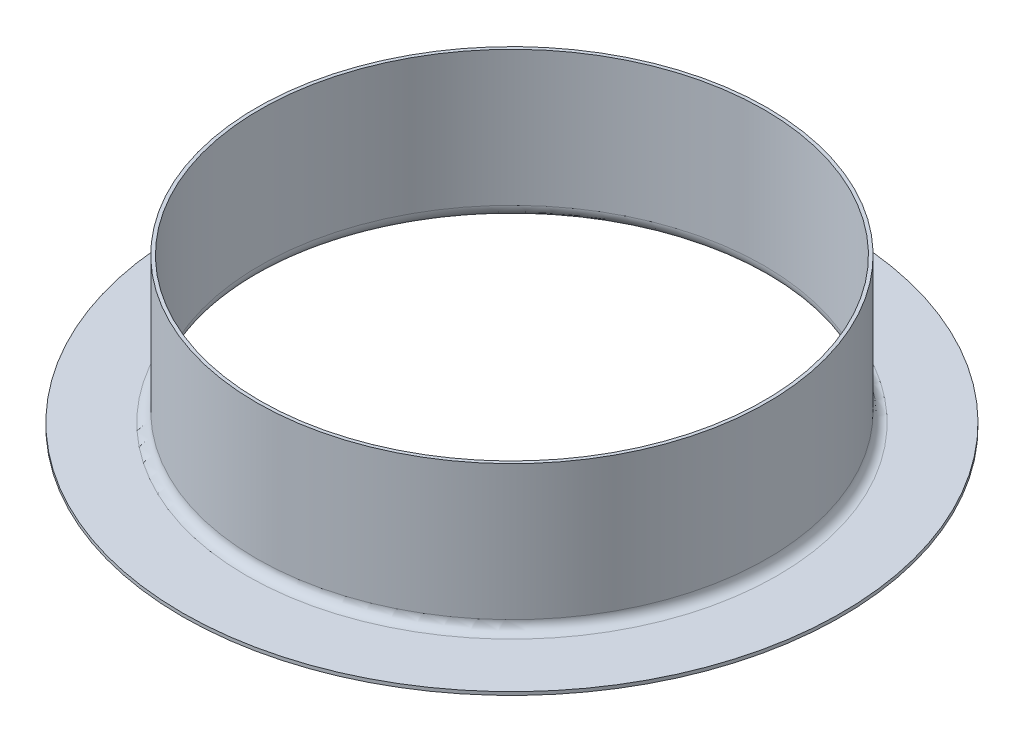
ISO-10303-21;
HEADER;
FILE_DESCRIPTION(('STEP AP214'),'2;1');
FILE_NAME('part.step','',(''),(''),'','','');
FILE_SCHEMA(('AUTOMOTIVE_DESIGN { 1 0 10303 214 1 1 1 1 }'));
ENDSEC;
DATA;
#1=APPLICATION_CONTEXT('core data for automotive mechanical design processes');
#2=APPLICATION_PROTOCOL_DEFINITION('international standard','automotive_design',2000,#1);
#3=PRODUCT_CONTEXT('',#1,'mechanical');
#4=PRODUCT('Part','Part','',(#3));
#5=PRODUCT_RELATED_PRODUCT_CATEGORY('part','',(#4));
#6=PRODUCT_DEFINITION_FORMATION('','',#4);
#7=PRODUCT_DEFINITION_CONTEXT('part definition',#1,'design');
#8=PRODUCT_DEFINITION('design','',#6,#7);
#9=PRODUCT_DEFINITION_SHAPE('','',#8);
#10=(LENGTH_UNIT() NAMED_UNIT(*) SI_UNIT(.MILLI.,.METRE.));
#11=(NAMED_UNIT(*) PLANE_ANGLE_UNIT() SI_UNIT($,.RADIAN.));
#12=(NAMED_UNIT(*) SI_UNIT($,.STERADIAN.) SOLID_ANGLE_UNIT());
#13=UNCERTAINTY_MEASURE_WITH_UNIT(LENGTH_MEASURE(1.E-05),#10,'distance_accuracy_value','');
#14=(GEOMETRIC_REPRESENTATION_CONTEXT(3) GLOBAL_UNCERTAINTY_ASSIGNED_CONTEXT((#13)) GLOBAL_UNIT_ASSIGNED_CONTEXT((#10,
#11,#12)) REPRESENTATION_CONTEXT('',''));
#15=CARTESIAN_POINT('',(0.,0.,0.));
#16=DIRECTION('',(0.,0.,1.));
#17=DIRECTION('',(1.,0.,0.));
#18=AXIS2_PLACEMENT_3D('',#15,#16,#17);
#19=CARTESIAN_POINT('',(0.,-0.999999999999995,0.));
#20=DIRECTION('',(0.,1.,0.));
#21=DIRECTION('',(0.,0.,1.));
#22=AXIS2_PLACEMENT_3D('',#19,#20,#21);
#23=CYLINDRICAL_SURFACE('',#22,100.);
#24=CARTESIAN_POINT('',(0.,-0.999999999999995,0.));
#25=DIRECTION('',(0.,1.,0.));
#26=DIRECTION('',(0.,0.,1.));
#27=AXIS2_PLACEMENT_3D('',#24,#25,#26);
#28=CIRCLE('',#27,100.);
#29=CARTESIAN_POINT('',(0.,-0.999999999999995,100.));
#30=VERTEX_POINT('',#29);
#31=EDGE_CURVE('E12',#30,#30,#28,.T.);
#32=ORIENTED_EDGE('',*,*,#31,.T.);
#33=EDGE_LOOP('',(#32));
#34=FACE_BOUND('',#33,.T.);
#35=CARTESIAN_POINT('',(0.,0.,0.));
#36=DIRECTION('',(0.,1.,0.));
#37=DIRECTION('',(0.,0.,1.));
#38=AXIS2_PLACEMENT_3D('',#35,#36,#37);
#39=CIRCLE('',#38,100.);
#40=CARTESIAN_POINT('',(0.,0.,100.));
#41=VERTEX_POINT('',#40);
#42=EDGE_CURVE('E101',#41,#41,#39,.T.);
#43=ORIENTED_EDGE('',*,*,#42,.F.);
#44=EDGE_LOOP('',(#43));
#45=FACE_BOUND('',#44,.T.);
#46=ADVANCED_FACE('F98',(#34,#45),#23,.T.);
#47=CARTESIAN_POINT('',(0.,-0.999999999999995,0.));
#48=DIRECTION('',(0.,1.,0.));
#49=DIRECTION('',(0.,0.,1.));
#50=AXIS2_PLACEMENT_3D('',#47,#48,#49);
#51=PLANE('',#50);
#52=ORIENTED_EDGE('',*,*,#31,.F.);
#53=EDGE_LOOP('',(#52));
#54=FACE_BOUND('',#53,.T.);
#55=CARTESIAN_POINT('',(0.,-0.999999999999995,0.));
#56=DIRECTION('',(0.,1.,0.));
#57=DIRECTION('',(0.,0.,1.));
#58=AXIS2_PLACEMENT_3D('',#55,#56,#57);
#59=CIRCLE('',#58,80.5);
#60=CARTESIAN_POINT('',(0.,-0.999999999999995,80.5));
#61=VERTEX_POINT('',#60);
#62=EDGE_CURVE('E171',#61,#61,#59,.T.);
#63=ORIENTED_EDGE('',*,*,#62,.T.);
#64=EDGE_LOOP('',(#63));
#65=FACE_BOUND('',#64,.T.);
#66=ADVANCED_FACE('F161',(#54,#65),#51,.F.);
#67=CARTESIAN_POINT('',(0.,0.,0.));
#68=DIRECTION('',(0.,1.,0.));
#69=DIRECTION('',(0.,0.,1.));
#70=AXIS2_PLACEMENT_3D('',#67,#68,#69);
#71=PLANE('',#70);
#72=ORIENTED_EDGE('',*,*,#42,.T.);
#73=EDGE_LOOP('',(#72));
#74=FACE_BOUND('',#73,.T.);
#75=CARTESIAN_POINT('',(0.,0.,0.));
#76=DIRECTION('',(0.,1.,0.));
#77=DIRECTION('',(0.,0.,1.));
#78=AXIS2_PLACEMENT_3D('',#75,#76,#77);
#79=CIRCLE('',#78,80.5);
#80=CARTESIAN_POINT('',(0.,0.,80.5));
#81=VERTEX_POINT('',#80);
#82=EDGE_CURVE('E136',#81,#81,#79,.T.);
#83=ORIENTED_EDGE('',*,*,#82,.F.);
#84=EDGE_LOOP('',(#83));
#85=FACE_BOUND('',#84,.T.);
#86=ADVANCED_FACE('F157',(#74,#85),#71,.T.);
#87=CARTESIAN_POINT('',(0.,44.,0.));
#88=DIRECTION('',(0.,-1.,0.));
#89=DIRECTION('',(0.,0.,-1.));
#90=AXIS2_PLACEMENT_3D('',#87,#88,#89);
#91=PLANE('',#90);
#92=CARTESIAN_POINT('',(0.,44.,0.));
#93=DIRECTION('',(0.,1.,0.));
#94=DIRECTION('',(0.,0.,1.));
#95=AXIS2_PLACEMENT_3D('',#92,#93,#94);
#96=CIRCLE('',#95,77.5);
#97=CARTESIAN_POINT('',(0.,44.,77.5));
#98=VERTEX_POINT('',#97);
#99=EDGE_CURVE('E133',#98,#98,#96,.T.);
#100=ORIENTED_EDGE('',*,*,#99,.T.);
#101=EDGE_LOOP('',(#100));
#102=FACE_BOUND('',#101,.T.);
#103=CARTESIAN_POINT('',(0.,44.,0.));
#104=DIRECTION('',(0.,1.,0.));
#105=DIRECTION('',(0.,0.,1.));
#106=AXIS2_PLACEMENT_3D('',#103,#104,#105);
#107=CIRCLE('',#106,76.5);
#108=CARTESIAN_POINT('',(0.,44.,76.5));
#109=VERTEX_POINT('',#108);
#110=EDGE_CURVE('E134',#109,#109,#107,.T.);
#111=ORIENTED_EDGE('',*,*,#110,.F.);
#112=EDGE_LOOP('',(#111));
#113=FACE_BOUND('',#112,.T.);
#114=ADVANCED_FACE('F131',(#102,#113),#91,.F.);
#115=CARTESIAN_POINT('',(0.,0.,0.));
#116=DIRECTION('',(0.,1.,0.));
#117=DIRECTION('',(0.,0.,1.));
#118=AXIS2_PLACEMENT_3D('',#115,#116,#117);
#119=CYLINDRICAL_SURFACE('',#118,76.5);
#120=DIRECTION('',(0.,1.,0.));
#121=VECTOR('',#120,1.);
#122=CARTESIAN_POINT('',(0.,0.,76.5));
#123=LINE('',#122,#121);
#124=CARTESIAN_POINT('',(0.,3.,76.5));
#125=VERTEX_POINT('',#124);
#126=EDGE_CURVE('E173',#125,#109,#123,.T.);
#127=ORIENTED_EDGE('',*,*,#126,.F.);
#128=CARTESIAN_POINT('',(0.,3.,0.));
#129=DIRECTION('',(0.,1.,0.));
#130=DIRECTION('',(0.,0.,1.));
#131=AXIS2_PLACEMENT_3D('',#128,#129,#130);
#132=CIRCLE('',#131,76.5);
#133=EDGE_CURVE('E172',#125,#125,#132,.T.);
#134=ORIENTED_EDGE('',*,*,#133,.F.);
#135=ORIENTED_EDGE('',*,*,#126,.T.);
#136=ORIENTED_EDGE('',*,*,#110,.T.);
#137=EDGE_LOOP('',(#127,#134,#135,#136));
#138=FACE_BOUND('',#137,.T.);
#139=ADVANCED_FACE('F183',(#138),#119,.F.);
#140=CARTESIAN_POINT('',(0.,3.,0.));
#141=DIRECTION('',(0.,1.,0.));
#142=DIRECTION('',(0.,0.,1.));
#143=AXIS2_PLACEMENT_3D('',#140,#141,#142);
#144=TOROIDAL_SURFACE('',#143,80.5,3.99999999999999);
#145=CARTESIAN_POINT('',(0.,3.,80.5));
#146=DIRECTION('',(-1.,0.,0.));
#147=DIRECTION('',(0.,0.,1.));
#148=AXIS2_PLACEMENT_3D('',#145,#146,#147);
#149=CIRCLE('',#148,3.99999999999999);
#150=EDGE_CURVE('E112',#61,#125,#149,.F.);
#151=ORIENTED_EDGE('',*,*,#150,.F.);
#152=ORIENTED_EDGE('',*,*,#62,.F.);
#153=ORIENTED_EDGE('',*,*,#150,.T.);
#154=ORIENTED_EDGE('',*,*,#133,.T.);
#155=EDGE_LOOP('',(#151,#152,#153,#154));
#156=FACE_BOUND('',#155,.T.);
#157=ADVANCED_FACE('F179',(#156),#144,.T.);
#158=CARTESIAN_POINT('',(0.,0.,0.));
#159=DIRECTION('',(0.,1.,0.));
#160=DIRECTION('',(0.,0.,1.));
#161=AXIS2_PLACEMENT_3D('',#158,#159,#160);
#162=CYLINDRICAL_SURFACE('',#161,77.5);
#163=DIRECTION('',(0.,1.,0.));
#164=VECTOR('',#163,1.);
#165=CARTESIAN_POINT('',(0.,0.,77.5));
#166=LINE('',#165,#164);
#167=CARTESIAN_POINT('',(0.,3.,77.5));
#168=VERTEX_POINT('',#167);
#169=EDGE_CURVE('E141',#168,#98,#166,.T.);
#170=ORIENTED_EDGE('',*,*,#169,.T.);
#171=ORIENTED_EDGE('',*,*,#99,.F.);
#172=ORIENTED_EDGE('',*,*,#169,.F.);
#173=CARTESIAN_POINT('',(0.,3.,0.));
#174=DIRECTION('',(0.,1.,0.));
#175=DIRECTION('',(0.,0.,1.));
#176=AXIS2_PLACEMENT_3D('',#173,#174,#175);
#177=CIRCLE('',#176,77.5);
#178=EDGE_CURVE('E144',#168,#168,#177,.T.);
#179=ORIENTED_EDGE('',*,*,#178,.T.);
#180=EDGE_LOOP('',(#170,#171,#172,#179));
#181=FACE_BOUND('',#180,.T.);
#182=ADVANCED_FACE('F142',(#181),#162,.T.);
#183=CARTESIAN_POINT('',(0.,3.,0.));
#184=DIRECTION('',(0.,1.,0.));
#185=DIRECTION('',(0.,0.,1.));
#186=AXIS2_PLACEMENT_3D('',#183,#184,#185);
#187=TOROIDAL_SURFACE('',#186,80.5,3.);
#188=CARTESIAN_POINT('',(0.,3.,80.5));
#189=DIRECTION('',(-1.,0.,0.));
#190=DIRECTION('',(0.,0.,1.));
#191=AXIS2_PLACEMENT_3D('',#188,#189,#190);
#192=CIRCLE('',#191,3.);
#193=EDGE_CURVE('E145',#81,#168,#192,.F.);
#194=ORIENTED_EDGE('',*,*,#193,.T.);
#195=ORIENTED_EDGE('',*,*,#178,.F.);
#196=ORIENTED_EDGE('',*,*,#193,.F.);
#197=ORIENTED_EDGE('',*,*,#82,.T.);
#198=EDGE_LOOP('',(#194,#195,#196,#197));
#199=FACE_BOUND('',#198,.T.);
#200=ADVANCED_FACE('F193',(#199),#187,.F.);
#201=CLOSED_SHELL('',(#46,#66,#86,#114,#139,#157,#182,#200));
#202=MANIFOLD_SOLID_BREP('B2',#201);
#203=ADVANCED_BREP_SHAPE_REPRESENTATION('',(#18,#202),#14);
#204=SHAPE_DEFINITION_REPRESENTATION(#9,#203);
ENDSEC;
END-ISO-10303-21;
